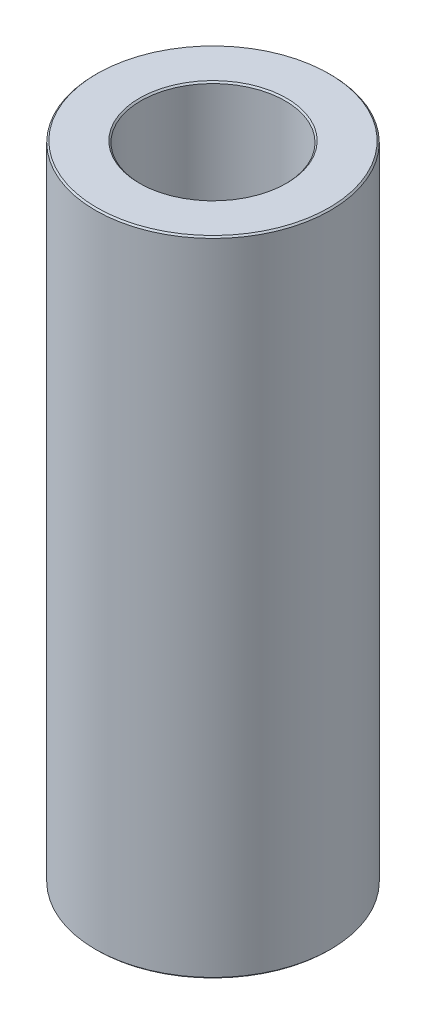
ISO-10303-21;
HEADER;
FILE_DESCRIPTION(('STEP AP214'),'2;1');
FILE_NAME('part.step','',(''),(''),'','','');
FILE_SCHEMA(('AUTOMOTIVE_DESIGN { 1 0 10303 214 1 1 1 1 }'));
ENDSEC;
DATA;
#1=APPLICATION_CONTEXT('core data for automotive mechanical design processes');
#2=APPLICATION_PROTOCOL_DEFINITION('international standard','automotive_design',2000,#1);
#3=PRODUCT_CONTEXT('',#1,'mechanical');
#4=PRODUCT('Part','Part','',(#3));
#5=PRODUCT_RELATED_PRODUCT_CATEGORY('part','',(#4));
#6=PRODUCT_DEFINITION_FORMATION('','',#4);
#7=PRODUCT_DEFINITION_CONTEXT('part definition',#1,'design');
#8=PRODUCT_DEFINITION('design','',#6,#7);
#9=PRODUCT_DEFINITION_SHAPE('','',#8);
#10=(LENGTH_UNIT() NAMED_UNIT(*) SI_UNIT(.MILLI.,.METRE.));
#11=(NAMED_UNIT(*) PLANE_ANGLE_UNIT() SI_UNIT($,.RADIAN.));
#12=(NAMED_UNIT(*) SI_UNIT($,.STERADIAN.) SOLID_ANGLE_UNIT());
#13=UNCERTAINTY_MEASURE_WITH_UNIT(LENGTH_MEASURE(1.E-05),#10,'distance_accuracy_value','');
#14=(GEOMETRIC_REPRESENTATION_CONTEXT(3) GLOBAL_UNCERTAINTY_ASSIGNED_CONTEXT((#13)) GLOBAL_UNIT_ASSIGNED_CONTEXT((#10,
#11,#12)) REPRESENTATION_CONTEXT('',''));
#15=CARTESIAN_POINT('',(0.,0.,0.));
#16=DIRECTION('',(0.,0.,1.));
#17=DIRECTION('',(1.,0.,0.));
#18=AXIS2_PLACEMENT_3D('',#15,#16,#17);
#19=CARTESIAN_POINT('',(0.,177.724273987455,0.));
#20=DIRECTION('',(0.,-1.,0.));
#21=DIRECTION('',(0.,0.,-1.));
#22=AXIS2_PLACEMENT_3D('',#19,#20,#21);
#23=CYLINDRICAL_SURFACE('',#22,32.5);
#24=CARTESIAN_POINT('',(0.,0.414427006892704,0.));
#25=DIRECTION('',(0.,1.,0.));
#26=DIRECTION('',(0.,0.,1.));
#27=AXIS2_PLACEMENT_3D('',#24,#25,#26);
#28=CIRCLE('',#27,32.5);
#29=CARTESIAN_POINT('',(0.,0.414427006892704,32.5));
#30=VERTEX_POINT('',#29);
#31=EDGE_CURVE('E10',#30,#30,#28,.T.);
#32=ORIENTED_EDGE('',*,*,#31,.T.);
#33=EDGE_LOOP('',(#32));
#34=FACE_BOUND('',#33,.T.);
#35=CARTESIAN_POINT('',(0.,177.309846980562,0.));
#36=DIRECTION('',(0.,1.,0.));
#37=DIRECTION('',(0.,0.,1.));
#38=AXIS2_PLACEMENT_3D('',#35,#36,#37);
#39=CIRCLE('',#38,32.5);
#40=CARTESIAN_POINT('',(0.,177.309846980562,32.5));
#41=VERTEX_POINT('',#40);
#42=EDGE_CURVE('E50',#41,#41,#39,.F.);
#43=ORIENTED_EDGE('',*,*,#42,.T.);
#44=EDGE_LOOP('',(#43));
#45=FACE_BOUND('',#44,.T.);
#46=ADVANCED_FACE('F39',(#34,#45),#23,.T.);
#47=CARTESIAN_POINT('',(0.,177.724273987455,0.));
#48=DIRECTION('',(0.,1.,0.));
#49=DIRECTION('',(0.,0.,1.));
#50=AXIS2_PLACEMENT_3D('',#47,#48,#49);
#51=PLANE('',#50);
#52=CARTESIAN_POINT('',(0.,177.724273987455,0.));
#53=DIRECTION('',(0.,1.,0.));
#54=DIRECTION('',(0.,0.,1.));
#55=AXIS2_PLACEMENT_3D('',#52,#53,#54);
#56=CIRCLE('',#55,20.3650712864687);
#57=CARTESIAN_POINT('',(0.,177.724273987455,20.3650712864687));
#58=VERTEX_POINT('',#57);
#59=EDGE_CURVE('E58',#58,#58,#56,.F.);
#60=ORIENTED_EDGE('',*,*,#59,.T.);
#61=EDGE_LOOP('',(#60));
#62=FACE_BOUND('',#61,.T.);
#63=CARTESIAN_POINT('',(0.,177.724273987455,0.));
#64=DIRECTION('',(0.,1.,0.));
#65=DIRECTION('',(0.,0.,1.));
#66=AXIS2_PLACEMENT_3D('',#63,#64,#65);
#67=CIRCLE('',#66,32.0855729931072);
#68=CARTESIAN_POINT('',(0.,177.724273987455,32.0855729931072));
#69=VERTEX_POINT('',#68);
#70=EDGE_CURVE('E61',#69,#69,#67,.T.);
#71=ORIENTED_EDGE('',*,*,#70,.T.);
#72=EDGE_LOOP('',(#71));
#73=FACE_BOUND('',#72,.T.);
#74=ADVANCED_FACE('F88',(#62,#73),#51,.T.);
#75=CARTESIAN_POINT('',(0.,0.,0.));
#76=DIRECTION('',(0.,1.,0.));
#77=DIRECTION('',(0.,0.,1.));
#78=AXIS2_PLACEMENT_3D('',#75,#76,#77);
#79=PLANE('',#78);
#80=CARTESIAN_POINT('',(0.,0.,0.));
#81=DIRECTION('',(0.,1.,0.));
#82=DIRECTION('',(0.,0.,1.));
#83=AXIS2_PLACEMENT_3D('',#80,#81,#82);
#84=CIRCLE('',#83,20.3650712864688);
#85=CARTESIAN_POINT('',(0.,0.,20.3650712864688));
#86=VERTEX_POINT('',#85);
#87=EDGE_CURVE('E51',#86,#86,#84,.T.);
#88=ORIENTED_EDGE('',*,*,#87,.T.);
#89=EDGE_LOOP('',(#88));
#90=FACE_BOUND('',#89,.T.);
#91=CARTESIAN_POINT('',(0.,0.,0.));
#92=DIRECTION('',(0.,1.,0.));
#93=DIRECTION('',(0.,0.,1.));
#94=AXIS2_PLACEMENT_3D('',#91,#92,#93);
#95=CIRCLE('',#94,32.0855729931073);
#96=CARTESIAN_POINT('',(0.,0.,32.0855729931073));
#97=VERTEX_POINT('',#96);
#98=EDGE_CURVE('E54',#97,#97,#95,.F.);
#99=ORIENTED_EDGE('',*,*,#98,.T.);
#100=EDGE_LOOP('',(#99));
#101=FACE_BOUND('',#100,.T.);
#102=ADVANCED_FACE('F83',(#90,#101),#79,.F.);
#103=CARTESIAN_POINT('',(0.,177.724273987455,0.));
#104=DIRECTION('',(0.,-1.,0.));
#105=DIRECTION('',(0.,0.,-1.));
#106=AXIS2_PLACEMENT_3D('',#103,#104,#105);
#107=CYLINDRICAL_SURFACE('',#106,19.950644279576);
#108=CARTESIAN_POINT('',(0.,177.309846980562,0.));
#109=DIRECTION('',(0.,1.,0.));
#110=DIRECTION('',(0.,0.,1.));
#111=AXIS2_PLACEMENT_3D('',#108,#109,#110);
#112=CIRCLE('',#111,19.950644279576);
#113=CARTESIAN_POINT('',(0.,177.309846980562,19.950644279576));
#114=VERTEX_POINT('',#113);
#115=EDGE_CURVE('E67',#114,#114,#112,.T.);
#116=ORIENTED_EDGE('',*,*,#115,.T.);
#117=EDGE_LOOP('',(#116));
#118=FACE_BOUND('',#117,.T.);
#119=CARTESIAN_POINT('',(0.,0.414427006892759,0.));
#120=DIRECTION('',(0.,1.,0.));
#121=DIRECTION('',(0.,0.,1.));
#122=AXIS2_PLACEMENT_3D('',#119,#120,#121);
#123=CIRCLE('',#122,19.950644279576);
#124=CARTESIAN_POINT('',(0.,0.414427006892759,19.950644279576));
#125=VERTEX_POINT('',#124);
#126=EDGE_CURVE('E69',#125,#125,#123,.F.);
#127=ORIENTED_EDGE('',*,*,#126,.T.);
#128=EDGE_LOOP('',(#127));
#129=FACE_BOUND('',#128,.T.);
#130=ADVANCED_FACE('F71',(#118,#129),#107,.F.);
#131=CARTESIAN_POINT('',(0.,177.309846980562,0.));
#132=DIRECTION('',(0.,1.,0.));
#133=DIRECTION('',(0.,0.,1.));
#134=AXIS2_PLACEMENT_3D('',#131,#132,#133);
#135=CONICAL_SURFACE('',#134,19.950644279576,0.785398163397432);
#136=ORIENTED_EDGE('',*,*,#59,.F.);
#137=EDGE_LOOP('',(#136));
#138=FACE_BOUND('',#137,.T.);
#139=ORIENTED_EDGE('',*,*,#115,.F.);
#140=EDGE_LOOP('',(#139));
#141=FACE_BOUND('',#140,.T.);
#142=ADVANCED_FACE('F77',(#138,#141),#135,.F.);
#143=CARTESIAN_POINT('',(0.,0.,0.));
#144=DIRECTION('',(0.,-1.,0.));
#145=DIRECTION('',(0.,0.,-1.));
#146=AXIS2_PLACEMENT_3D('',#143,#144,#145);
#147=CONICAL_SURFACE('',#146,20.3650712864688,0.785398163397465);
#148=ORIENTED_EDGE('',*,*,#126,.F.);
#149=EDGE_LOOP('',(#148));
#150=FACE_BOUND('',#149,.T.);
#151=ORIENTED_EDGE('',*,*,#87,.F.);
#152=EDGE_LOOP('',(#151));
#153=FACE_BOUND('',#152,.T.);
#154=ADVANCED_FACE('F73',(#150,#153),#147,.F.);
#155=CARTESIAN_POINT('',(0.,0.414427006892704,0.));
#156=DIRECTION('',(0.,1.,0.));
#157=DIRECTION('',(0.,0.,1.));
#158=AXIS2_PLACEMENT_3D('',#155,#156,#157);
#159=CONICAL_SURFACE('',#158,32.5,0.785398163397482);
#160=ORIENTED_EDGE('',*,*,#98,.F.);
#161=EDGE_LOOP('',(#160));
#162=FACE_BOUND('',#161,.T.);
#163=ORIENTED_EDGE('',*,*,#31,.F.);
#164=EDGE_LOOP('',(#163));
#165=FACE_BOUND('',#164,.T.);
#166=ADVANCED_FACE('F76',(#162,#165),#159,.T.);
#167=CARTESIAN_POINT('',(0.,177.724273987455,0.));
#168=DIRECTION('',(0.,-1.,0.));
#169=DIRECTION('',(0.,0.,-1.));
#170=AXIS2_PLACEMENT_3D('',#167,#168,#169);
#171=CONICAL_SURFACE('',#170,32.0855729931072,0.785398163397448);
#172=ORIENTED_EDGE('',*,*,#42,.F.);
#173=EDGE_LOOP('',(#172));
#174=FACE_BOUND('',#173,.T.);
#175=ORIENTED_EDGE('',*,*,#70,.F.);
#176=EDGE_LOOP('',(#175));
#177=FACE_BOUND('',#176,.T.);
#178=ADVANCED_FACE('F45',(#174,#177),#171,.T.);
#179=CLOSED_SHELL('',(#46,#74,#102,#130,#142,#154,#166,#178));
#180=MANIFOLD_SOLID_BREP('B2',#179);
#181=ADVANCED_BREP_SHAPE_REPRESENTATION('',(#18,#180),#14);
#182=SHAPE_DEFINITION_REPRESENTATION(#9,#181);
ENDSEC;
END-ISO-10303-21;
